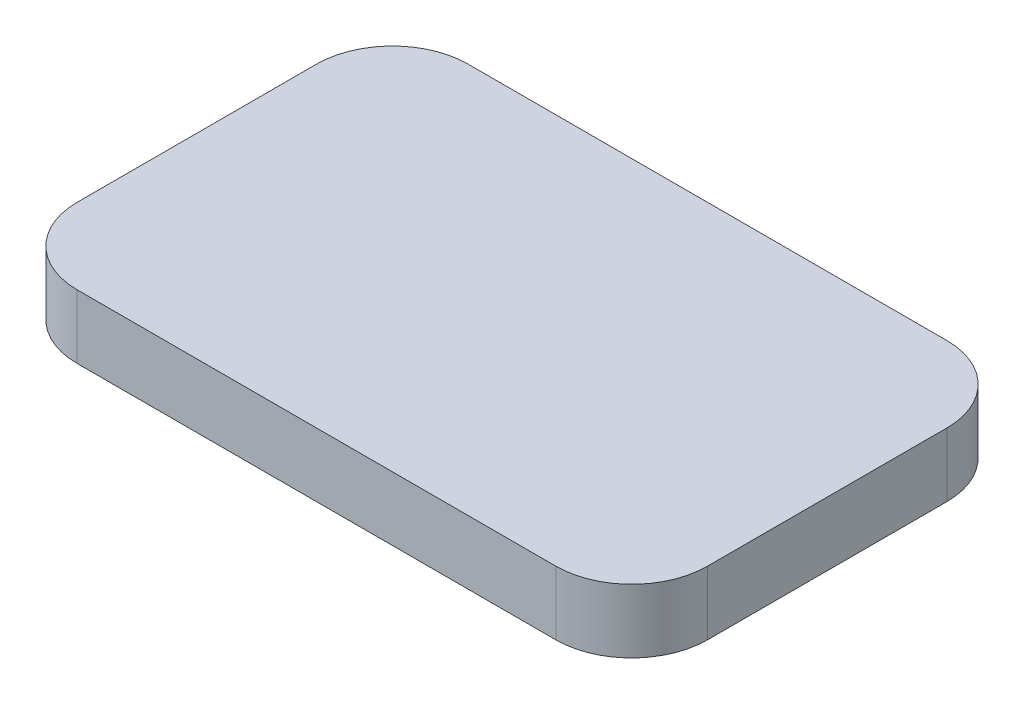
ISO-10303-21;
HEADER;
FILE_DESCRIPTION(('STEP AP214'),'2;1');
FILE_NAME('part.step','',(''),(''),'','','');
FILE_SCHEMA(('AUTOMOTIVE_DESIGN { 1 0 10303 214 1 1 1 1 }'));
ENDSEC;
DATA;
#1=APPLICATION_CONTEXT('core data for automotive mechanical design processes');
#2=APPLICATION_PROTOCOL_DEFINITION('international standard','automotive_design',2000,#1);
#3=PRODUCT_CONTEXT('',#1,'mechanical');
#4=PRODUCT('Part','Part','',(#3));
#5=PRODUCT_RELATED_PRODUCT_CATEGORY('part','',(#4));
#6=PRODUCT_DEFINITION_FORMATION('','',#4);
#7=PRODUCT_DEFINITION_CONTEXT('part definition',#1,'design');
#8=PRODUCT_DEFINITION('design','',#6,#7);
#9=PRODUCT_DEFINITION_SHAPE('','',#8);
#10=(LENGTH_UNIT() NAMED_UNIT(*) SI_UNIT(.MILLI.,.METRE.));
#11=(NAMED_UNIT(*) PLANE_ANGLE_UNIT() SI_UNIT($,.RADIAN.));
#12=(NAMED_UNIT(*) SI_UNIT($,.STERADIAN.) SOLID_ANGLE_UNIT());
#13=UNCERTAINTY_MEASURE_WITH_UNIT(LENGTH_MEASURE(1.E-05),#10,'distance_accuracy_value','');
#14=(GEOMETRIC_REPRESENTATION_CONTEXT(3) GLOBAL_UNCERTAINTY_ASSIGNED_CONTEXT((#13)) GLOBAL_UNIT_ASSIGNED_CONTEXT((#10,
#11,#12)) REPRESENTATION_CONTEXT('',''));
#15=CARTESIAN_POINT('',(0.,0.,0.));
#16=DIRECTION('',(0.,0.,1.));
#17=DIRECTION('',(1.,0.,0.));
#18=AXIS2_PLACEMENT_3D('',#15,#16,#17);
#19=CARTESIAN_POINT('',(0.,0.,0.));
#20=DIRECTION('',(0.,-1.,0.));
#21=DIRECTION('',(0.,0.,-1.));
#22=AXIS2_PLACEMENT_3D('',#19,#20,#21);
#23=PLANE('',#22);
#24=DIRECTION('',(-1.,0.,0.));
#25=VECTOR('',#24,1.);
#26=CARTESIAN_POINT('',(6.0045,0.,-6.15000000000001));
#27=LINE('',#26,#25);
#28=CARTESIAN_POINT('',(6.0045,0.,-6.15000000000001));
#29=VERTEX_POINT('',#28);
#30=CARTESIAN_POINT('',(-5.9955,0.,-6.15000000000001));
#31=VERTEX_POINT('',#30);
#32=EDGE_CURVE('E117',#29,#31,#27,.T.);
#33=ORIENTED_EDGE('',*,*,#32,.F.);
#34=CARTESIAN_POINT('',(6.0045,0.,-4.25));
#35=DIRECTION('',(0.,1.,0.));
#36=DIRECTION('',(0.,0.,1.));
#37=AXIS2_PLACEMENT_3D('',#34,#35,#36);
#38=CIRCLE('',#37,1.9);
#39=CARTESIAN_POINT('',(7.9045,0.,-4.25));
#40=VERTEX_POINT('',#39);
#41=EDGE_CURVE('E59',#40,#29,#38,.T.);
#42=ORIENTED_EDGE('',*,*,#41,.F.);
#43=DIRECTION('',(0.,0.,-1.));
#44=VECTOR('',#43,1.);
#45=CARTESIAN_POINT('',(7.9045,0.,1.75));
#46=LINE('',#45,#44);
#47=CARTESIAN_POINT('',(7.9045,0.,1.74999999999999));
#48=VERTEX_POINT('',#47);
#49=EDGE_CURVE('E132',#48,#40,#46,.T.);
#50=ORIENTED_EDGE('',*,*,#49,.F.);
#51=CARTESIAN_POINT('',(6.0045,0.,1.74999999999999));
#52=DIRECTION('',(0.,1.,0.));
#53=DIRECTION('',(0.,0.,1.));
#54=AXIS2_PLACEMENT_3D('',#51,#52,#53);
#55=CIRCLE('',#54,1.9);
#56=CARTESIAN_POINT('',(6.0045,0.,3.65));
#57=VERTEX_POINT('',#56);
#58=EDGE_CURVE('E129',#57,#48,#55,.T.);
#59=ORIENTED_EDGE('',*,*,#58,.F.);
#60=DIRECTION('',(1.,0.,0.));
#61=VECTOR('',#60,1.);
#62=CARTESIAN_POINT('',(-5.9955,0.,3.65));
#63=LINE('',#62,#61);
#64=CARTESIAN_POINT('',(-5.9955,0.,3.65));
#65=VERTEX_POINT('',#64);
#66=EDGE_CURVE('E123',#65,#57,#63,.T.);
#67=ORIENTED_EDGE('',*,*,#66,.F.);
#68=CARTESIAN_POINT('',(-5.9955,0.,1.74999999999999));
#69=DIRECTION('',(0.,1.,0.));
#70=DIRECTION('',(0.,0.,1.));
#71=AXIS2_PLACEMENT_3D('',#68,#69,#70);
#72=CIRCLE('',#71,1.9);
#73=CARTESIAN_POINT('',(-7.8955,0.,1.74999999999999));
#74=VERTEX_POINT('',#73);
#75=EDGE_CURVE('E121',#74,#65,#72,.T.);
#76=ORIENTED_EDGE('',*,*,#75,.F.);
#77=DIRECTION('',(0.,0.,1.));
#78=VECTOR('',#77,1.);
#79=CARTESIAN_POINT('',(-7.8955,0.,-4.25));
#80=LINE('',#79,#78);
#81=CARTESIAN_POINT('',(-7.8955,0.,-4.25));
#82=VERTEX_POINT('',#81);
#83=EDGE_CURVE('E104',#82,#74,#80,.T.);
#84=ORIENTED_EDGE('',*,*,#83,.F.);
#85=CARTESIAN_POINT('',(-5.9955,0.,-4.25));
#86=DIRECTION('',(0.,1.,0.));
#87=DIRECTION('',(0.,0.,1.));
#88=AXIS2_PLACEMENT_3D('',#85,#86,#87);
#89=CIRCLE('',#88,1.9);
#90=EDGE_CURVE('E112',#31,#82,#89,.T.);
#91=ORIENTED_EDGE('',*,*,#90,.F.);
#92=EDGE_LOOP('',(#33,#42,#50,#59,#67,#76,#84,#91));
#93=FACE_BOUND('',#92,.T.);
#94=ADVANCED_FACE('F35',(#93),#23,.T.);
#95=CARTESIAN_POINT('',(6.0045,0.,-4.25));
#96=DIRECTION('',(0.,1.,0.));
#97=DIRECTION('',(0.,0.,1.));
#98=AXIS2_PLACEMENT_3D('',#95,#96,#97);
#99=CYLINDRICAL_SURFACE('',#98,1.9);
#100=CARTESIAN_POINT('',(6.0045,1.6,-4.25));
#101=DIRECTION('',(0.,1.,0.));
#102=DIRECTION('',(0.,0.,1.));
#103=AXIS2_PLACEMENT_3D('',#100,#101,#102);
#104=CIRCLE('',#103,1.9);
#105=CARTESIAN_POINT('',(7.9045,1.6,-4.25));
#106=VERTEX_POINT('',#105);
#107=CARTESIAN_POINT('',(6.0045,1.6,-6.15000000000001));
#108=VERTEX_POINT('',#107);
#109=EDGE_CURVE('E135',#106,#108,#104,.T.);
#110=ORIENTED_EDGE('',*,*,#109,.F.);
#111=DIRECTION('',(0.,1.,0.));
#112=VECTOR('',#111,1.);
#113=CARTESIAN_POINT('',(7.9045,0.,-4.25));
#114=LINE('',#113,#112);
#115=EDGE_CURVE('E12',#40,#106,#114,.T.);
#116=ORIENTED_EDGE('',*,*,#115,.F.);
#117=ORIENTED_EDGE('',*,*,#41,.T.);
#118=DIRECTION('',(0.,1.,0.));
#119=VECTOR('',#118,1.);
#120=CARTESIAN_POINT('',(6.0045,0.,-6.15000000000001));
#121=LINE('',#120,#119);
#122=EDGE_CURVE('E38',#29,#108,#121,.T.);
#123=ORIENTED_EDGE('',*,*,#122,.T.);
#124=EDGE_LOOP('',(#110,#116,#117,#123));
#125=FACE_BOUND('',#124,.T.);
#126=ADVANCED_FACE('F163',(#125),#99,.T.);
#127=CARTESIAN_POINT('',(7.9045,0.,1.75));
#128=DIRECTION('',(1.,0.,0.));
#129=DIRECTION('',(0.,0.,-1.));
#130=AXIS2_PLACEMENT_3D('',#127,#128,#129);
#131=PLANE('',#130);
#132=DIRECTION('',(0.,0.,-1.));
#133=VECTOR('',#132,1.);
#134=CARTESIAN_POINT('',(7.9045,1.6,1.75));
#135=LINE('',#134,#133);
#136=CARTESIAN_POINT('',(7.9045,1.6,1.74999999999999));
#137=VERTEX_POINT('',#136);
#138=EDGE_CURVE('E152',#137,#106,#135,.T.);
#139=ORIENTED_EDGE('',*,*,#138,.F.);
#140=DIRECTION('',(0.,1.,0.));
#141=VECTOR('',#140,1.);
#142=CARTESIAN_POINT('',(7.9045,0.,1.74999999999999));
#143=LINE('',#142,#141);
#144=EDGE_CURVE('E43',#48,#137,#143,.T.);
#145=ORIENTED_EDGE('',*,*,#144,.F.);
#146=ORIENTED_EDGE('',*,*,#49,.T.);
#147=ORIENTED_EDGE('',*,*,#115,.T.);
#148=EDGE_LOOP('',(#139,#145,#146,#147));
#149=FACE_BOUND('',#148,.T.);
#150=ADVANCED_FACE('F170',(#149),#131,.T.);
#151=CARTESIAN_POINT('',(6.0045,0.,1.74999999999999));
#152=DIRECTION('',(0.,1.,0.));
#153=DIRECTION('',(0.,0.,1.));
#154=AXIS2_PLACEMENT_3D('',#151,#152,#153);
#155=CYLINDRICAL_SURFACE('',#154,1.9);
#156=CARTESIAN_POINT('',(6.0045,1.6,1.74999999999999));
#157=DIRECTION('',(0.,1.,0.));
#158=DIRECTION('',(0.,0.,1.));
#159=AXIS2_PLACEMENT_3D('',#156,#157,#158);
#160=CIRCLE('',#159,1.9);
#161=CARTESIAN_POINT('',(6.0045,1.6,3.65));
#162=VERTEX_POINT('',#161);
#163=EDGE_CURVE('E149',#162,#137,#160,.T.);
#164=ORIENTED_EDGE('',*,*,#163,.F.);
#165=DIRECTION('',(0.,1.,0.));
#166=VECTOR('',#165,1.);
#167=CARTESIAN_POINT('',(6.0045,0.,3.65));
#168=LINE('',#167,#166);
#169=EDGE_CURVE('E156',#57,#162,#168,.T.);
#170=ORIENTED_EDGE('',*,*,#169,.F.);
#171=ORIENTED_EDGE('',*,*,#58,.T.);
#172=ORIENTED_EDGE('',*,*,#144,.T.);
#173=EDGE_LOOP('',(#164,#170,#171,#172));
#174=FACE_BOUND('',#173,.T.);
#175=ADVANCED_FACE('F175',(#174),#155,.T.);
#176=CARTESIAN_POINT('',(-5.9955,0.,3.65));
#177=DIRECTION('',(0.,0.,1.));
#178=DIRECTION('',(1.,0.,0.));
#179=AXIS2_PLACEMENT_3D('',#176,#177,#178);
#180=PLANE('',#179);
#181=DIRECTION('',(1.,0.,0.));
#182=VECTOR('',#181,1.);
#183=CARTESIAN_POINT('',(-5.9955,1.6,3.65));
#184=LINE('',#183,#182);
#185=CARTESIAN_POINT('',(-5.9955,1.6,3.65));
#186=VERTEX_POINT('',#185);
#187=EDGE_CURVE('E146',#186,#162,#184,.T.);
#188=ORIENTED_EDGE('',*,*,#187,.F.);
#189=DIRECTION('',(0.,1.,0.));
#190=VECTOR('',#189,1.);
#191=CARTESIAN_POINT('',(-5.9955,0.,3.65));
#192=LINE('',#191,#190);
#193=EDGE_CURVE('E158',#65,#186,#192,.T.);
#194=ORIENTED_EDGE('',*,*,#193,.F.);
#195=ORIENTED_EDGE('',*,*,#66,.T.);
#196=ORIENTED_EDGE('',*,*,#169,.T.);
#197=EDGE_LOOP('',(#188,#194,#195,#196));
#198=FACE_BOUND('',#197,.T.);
#199=ADVANCED_FACE('F178',(#198),#180,.T.);
#200=CARTESIAN_POINT('',(-5.9955,0.,1.74999999999999));
#201=DIRECTION('',(0.,1.,0.));
#202=DIRECTION('',(0.,0.,1.));
#203=AXIS2_PLACEMENT_3D('',#200,#201,#202);
#204=CYLINDRICAL_SURFACE('',#203,1.9);
#205=CARTESIAN_POINT('',(-5.9955,1.6,1.74999999999999));
#206=DIRECTION('',(0.,1.,0.));
#207=DIRECTION('',(0.,0.,1.));
#208=AXIS2_PLACEMENT_3D('',#205,#206,#207);
#209=CIRCLE('',#208,1.9);
#210=CARTESIAN_POINT('',(-7.8955,1.6,1.74999999999999));
#211=VERTEX_POINT('',#210);
#212=EDGE_CURVE('E143',#211,#186,#209,.T.);
#213=ORIENTED_EDGE('',*,*,#212,.F.);
#214=DIRECTION('',(0.,1.,0.));
#215=VECTOR('',#214,1.);
#216=CARTESIAN_POINT('',(-7.8955,0.,1.74999999999999));
#217=LINE('',#216,#215);
#218=EDGE_CURVE('E108',#74,#211,#217,.T.);
#219=ORIENTED_EDGE('',*,*,#218,.F.);
#220=ORIENTED_EDGE('',*,*,#75,.T.);
#221=ORIENTED_EDGE('',*,*,#193,.T.);
#222=EDGE_LOOP('',(#213,#219,#220,#221));
#223=FACE_BOUND('',#222,.T.);
#224=ADVANCED_FACE('F181',(#223),#204,.T.);
#225=CARTESIAN_POINT('',(-7.8955,0.,-4.25));
#226=DIRECTION('',(-1.,0.,0.));
#227=DIRECTION('',(0.,0.,1.));
#228=AXIS2_PLACEMENT_3D('',#225,#226,#227);
#229=PLANE('',#228);
#230=DIRECTION('',(0.,0.,1.));
#231=VECTOR('',#230,1.);
#232=CARTESIAN_POINT('',(-7.8955,1.6,-4.25));
#233=LINE('',#232,#231);
#234=CARTESIAN_POINT('',(-7.8955,1.6,-4.25));
#235=VERTEX_POINT('',#234);
#236=EDGE_CURVE('E107',#235,#211,#233,.T.);
#237=ORIENTED_EDGE('',*,*,#236,.F.);
#238=DIRECTION('',(0.,1.,0.));
#239=VECTOR('',#238,1.);
#240=CARTESIAN_POINT('',(-7.8955,0.,-4.25));
#241=LINE('',#240,#239);
#242=EDGE_CURVE('E100',#82,#235,#241,.T.);
#243=ORIENTED_EDGE('',*,*,#242,.F.);
#244=ORIENTED_EDGE('',*,*,#83,.T.);
#245=ORIENTED_EDGE('',*,*,#218,.T.);
#246=EDGE_LOOP('',(#237,#243,#244,#245));
#247=FACE_BOUND('',#246,.T.);
#248=ADVANCED_FACE('F102',(#247),#229,.T.);
#249=CARTESIAN_POINT('',(-5.9955,0.,-4.25));
#250=DIRECTION('',(0.,1.,0.));
#251=DIRECTION('',(0.,0.,1.));
#252=AXIS2_PLACEMENT_3D('',#249,#250,#251);
#253=CYLINDRICAL_SURFACE('',#252,1.9);
#254=CARTESIAN_POINT('',(-5.9955,1.6,-4.25));
#255=DIRECTION('',(0.,1.,0.));
#256=DIRECTION('',(0.,0.,1.));
#257=AXIS2_PLACEMENT_3D('',#254,#255,#256);
#258=CIRCLE('',#257,1.9);
#259=CARTESIAN_POINT('',(-5.9955,1.6,-6.15000000000001));
#260=VERTEX_POINT('',#259);
#261=EDGE_CURVE('E51',#260,#235,#258,.T.);
#262=ORIENTED_EDGE('',*,*,#261,.F.);
#263=DIRECTION('',(0.,1.,0.));
#264=VECTOR('',#263,1.);
#265=CARTESIAN_POINT('',(-5.9955,0.,-6.15000000000001));
#266=LINE('',#265,#264);
#267=EDGE_CURVE('E109',#31,#260,#266,.T.);
#268=ORIENTED_EDGE('',*,*,#267,.F.);
#269=ORIENTED_EDGE('',*,*,#90,.T.);
#270=ORIENTED_EDGE('',*,*,#242,.T.);
#271=EDGE_LOOP('',(#262,#268,#269,#270));
#272=FACE_BOUND('',#271,.T.);
#273=ADVANCED_FACE('F113',(#272),#253,.T.);
#274=CARTESIAN_POINT('',(6.0045,0.,-6.15000000000001));
#275=DIRECTION('',(0.,0.,-1.));
#276=DIRECTION('',(-1.,0.,0.));
#277=AXIS2_PLACEMENT_3D('',#274,#275,#276);
#278=PLANE('',#277);
#279=DIRECTION('',(-1.,0.,0.));
#280=VECTOR('',#279,1.);
#281=CARTESIAN_POINT('',(6.0045,1.6,-6.15000000000001));
#282=LINE('',#281,#280);
#283=EDGE_CURVE('E138',#108,#260,#282,.T.);
#284=ORIENTED_EDGE('',*,*,#283,.F.);
#285=ORIENTED_EDGE('',*,*,#122,.F.);
#286=ORIENTED_EDGE('',*,*,#32,.T.);
#287=ORIENTED_EDGE('',*,*,#267,.T.);
#288=EDGE_LOOP('',(#284,#285,#286,#287));
#289=FACE_BOUND('',#288,.T.);
#290=ADVANCED_FACE('F164',(#289),#278,.T.);
#291=CARTESIAN_POINT('',(0.,1.6,0.));
#292=DIRECTION('',(0.,-1.,0.));
#293=DIRECTION('',(0.,0.,-1.));
#294=AXIS2_PLACEMENT_3D('',#291,#292,#293);
#295=PLANE('',#294);
#296=ORIENTED_EDGE('',*,*,#109,.T.);
#297=ORIENTED_EDGE('',*,*,#283,.T.);
#298=ORIENTED_EDGE('',*,*,#261,.T.);
#299=ORIENTED_EDGE('',*,*,#236,.T.);
#300=ORIENTED_EDGE('',*,*,#212,.T.);
#301=ORIENTED_EDGE('',*,*,#187,.T.);
#302=ORIENTED_EDGE('',*,*,#163,.T.);
#303=ORIENTED_EDGE('',*,*,#138,.T.);
#304=EDGE_LOOP('',(#296,#297,#298,#299,#300,#301,#302,#303));
#305=FACE_BOUND('',#304,.T.);
#306=ADVANCED_FACE('F166',(#305),#295,.F.);
#307=CLOSED_SHELL('',(#94,#126,#150,#175,#199,#224,#248,#273,#290,#306));
#308=MANIFOLD_SOLID_BREP('B2',#307);
#309=ADVANCED_BREP_SHAPE_REPRESENTATION('',(#18,#308),#14);
#310=SHAPE_DEFINITION_REPRESENTATION(#9,#309);
ENDSEC;
END-ISO-10303-21;
